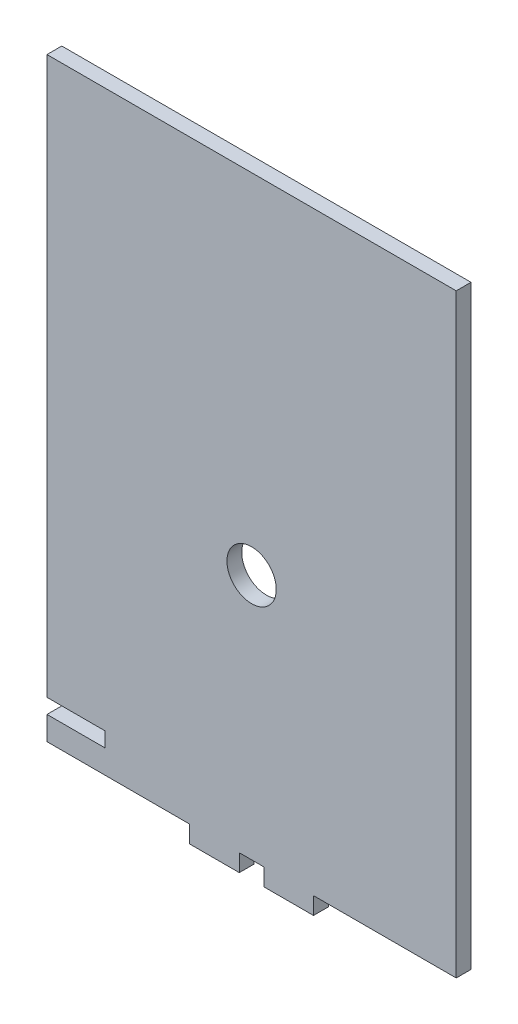
ISO-10303-21;
HEADER;
FILE_DESCRIPTION(('STEP AP214'),'2;1');
FILE_NAME('part.step','',(''),(''),'','','');
FILE_SCHEMA(('AUTOMOTIVE_DESIGN { 1 0 10303 214 1 1 1 1 }'));
ENDSEC;
DATA;
#1=APPLICATION_CONTEXT('core data for automotive mechanical design processes');
#2=APPLICATION_PROTOCOL_DEFINITION('international standard','automotive_design',2000,#1);
#3=PRODUCT_CONTEXT('',#1,'mechanical');
#4=PRODUCT('Part','Part','',(#3));
#5=PRODUCT_RELATED_PRODUCT_CATEGORY('part','',(#4));
#6=PRODUCT_DEFINITION_FORMATION('','',#4);
#7=PRODUCT_DEFINITION_CONTEXT('part definition',#1,'design');
#8=PRODUCT_DEFINITION('design','',#6,#7);
#9=PRODUCT_DEFINITION_SHAPE('','',#8);
#10=(LENGTH_UNIT() NAMED_UNIT(*) SI_UNIT(.MILLI.,.METRE.));
#11=(NAMED_UNIT(*) PLANE_ANGLE_UNIT() SI_UNIT($,.RADIAN.));
#12=(NAMED_UNIT(*) SI_UNIT($,.STERADIAN.) SOLID_ANGLE_UNIT());
#13=UNCERTAINTY_MEASURE_WITH_UNIT(LENGTH_MEASURE(1.E-05),#10,'distance_accuracy_value','');
#14=(GEOMETRIC_REPRESENTATION_CONTEXT(3) GLOBAL_UNCERTAINTY_ASSIGNED_CONTEXT((#13)) GLOBAL_UNIT_ASSIGNED_CONTEXT((#10,
#11,#12)) REPRESENTATION_CONTEXT('',''));
#15=CARTESIAN_POINT('',(0.,0.,0.));
#16=DIRECTION('',(0.,0.,1.));
#17=DIRECTION('',(1.,0.,0.));
#18=AXIS2_PLACEMENT_3D('',#15,#16,#17);
#19=CARTESIAN_POINT('',(43.8354800636653,2.00252965900021E-12,3.));
#20=DIRECTION('',(-1.,0.,0.));
#21=DIRECTION('',(0.,-1.,0.));
#22=AXIS2_PLACEMENT_3D('',#19,#20,#21);
#23=PLANE('',#22);
#24=DIRECTION('',(0.,1.,0.));
#25=VECTOR('',#24,1.);
#26=CARTESIAN_POINT('',(43.8354800636653,2.00252965900021E-12,0.));
#27=LINE('',#26,#25);
#28=CARTESIAN_POINT('',(43.8354800636669,-35.8425477631779,0.));
#29=VERTEX_POINT('',#28);
#30=CARTESIAN_POINT('',(43.8354800636668,-32.3490144152469,0.));
#31=VERTEX_POINT('',#30);
#32=EDGE_CURVE('E184',#29,#31,#27,.T.);
#33=ORIENTED_EDGE('',*,*,#32,.F.);
#34=DIRECTION('',(0.,0.,-1.));
#35=VECTOR('',#34,1.);
#36=CARTESIAN_POINT('',(43.8354800636669,-35.8425477631779,3.));
#37=LINE('',#36,#35);
#38=CARTESIAN_POINT('',(43.8354800636669,-35.8425477631779,3.));
#39=VERTEX_POINT('',#38);
#40=EDGE_CURVE('E11',#39,#29,#37,.T.);
#41=ORIENTED_EDGE('',*,*,#40,.F.);
#42=DIRECTION('',(0.,1.,0.));
#43=VECTOR('',#42,1.);
#44=CARTESIAN_POINT('',(43.8354800636653,2.00252965900021E-12,3.));
#45=LINE('',#44,#43);
#46=CARTESIAN_POINT('',(43.8354800636668,-32.3490144152469,3.));
#47=VERTEX_POINT('',#46);
#48=EDGE_CURVE('E279',#39,#47,#45,.T.);
#49=ORIENTED_EDGE('',*,*,#48,.T.);
#50=DIRECTION('',(0.,0.,-1.));
#51=VECTOR('',#50,1.);
#52=CARTESIAN_POINT('',(43.8354800636668,-32.3490144152469,3.));
#53=LINE('',#52,#51);
#54=EDGE_CURVE('E50',#47,#31,#53,.T.);
#55=ORIENTED_EDGE('',*,*,#54,.T.);
#56=EDGE_LOOP('',(#33,#41,#49,#55));
#57=FACE_BOUND('',#56,.T.);
#58=ADVANCED_FACE('F33',(#57),#23,.T.);
#59=CARTESIAN_POINT('',(0.,-35.8425477631779,3.));
#60=DIRECTION('',(0.,-1.,0.));
#61=DIRECTION('',(0.,0.,-1.));
#62=AXIS2_PLACEMENT_3D('',#59,#60,#61);
#63=PLANE('',#62);
#64=DIRECTION('',(-1.,0.,0.));
#65=VECTOR('',#64,1.);
#66=CARTESIAN_POINT('',(0.,-35.8425477631779,0.));
#67=LINE('',#66,#65);
#68=CARTESIAN_POINT('',(53.8854800636669,-35.8425477631779,0.));
#69=VERTEX_POINT('',#68);
#70=EDGE_CURVE('E186',#69,#29,#67,.T.);
#71=ORIENTED_EDGE('',*,*,#70,.F.);
#72=DIRECTION('',(0.,0.,-1.));
#73=VECTOR('',#72,1.);
#74=CARTESIAN_POINT('',(53.8854800636669,-35.8425477631779,3.));
#75=LINE('',#74,#73);
#76=CARTESIAN_POINT('',(53.8854800636669,-35.8425477631779,3.));
#77=VERTEX_POINT('',#76);
#78=EDGE_CURVE('E42',#77,#69,#75,.T.);
#79=ORIENTED_EDGE('',*,*,#78,.F.);
#80=DIRECTION('',(-1.,0.,0.));
#81=VECTOR('',#80,1.);
#82=CARTESIAN_POINT('',(0.,-35.8425477631779,3.));
#83=LINE('',#82,#81);
#84=EDGE_CURVE('E275',#77,#39,#83,.T.);
#85=ORIENTED_EDGE('',*,*,#84,.T.);
#86=ORIENTED_EDGE('',*,*,#40,.T.);
#87=EDGE_LOOP('',(#71,#79,#85,#86));
#88=FACE_BOUND('',#87,.T.);
#89=ADVANCED_FACE('F263',(#88),#63,.T.);
#90=CARTESIAN_POINT('',(53.8854800636669,0.,3.));
#91=DIRECTION('',(1.,0.,0.));
#92=DIRECTION('',(0.,0.,-1.));
#93=AXIS2_PLACEMENT_3D('',#90,#91,#92);
#94=PLANE('',#93);
#95=DIRECTION('',(0.,-1.,0.));
#96=VECTOR('',#95,1.);
#97=CARTESIAN_POINT('',(53.8854800636669,0.,0.));
#98=LINE('',#97,#96);
#99=CARTESIAN_POINT('',(53.8854800636669,-32.3425477631779,0.));
#100=VERTEX_POINT('',#99);
#101=EDGE_CURVE('E189',#100,#69,#98,.T.);
#102=ORIENTED_EDGE('',*,*,#101,.F.);
#103=DIRECTION('',(0.,0.,-1.));
#104=VECTOR('',#103,1.);
#105=CARTESIAN_POINT('',(53.8854800636669,-32.3425477631779,3.));
#106=LINE('',#105,#104);
#107=CARTESIAN_POINT('',(53.8854800636669,-32.3425477631779,3.));
#108=VERTEX_POINT('',#107);
#109=EDGE_CURVE('E252',#108,#100,#106,.T.);
#110=ORIENTED_EDGE('',*,*,#109,.F.);
#111=DIRECTION('',(0.,-1.,0.));
#112=VECTOR('',#111,1.);
#113=CARTESIAN_POINT('',(53.8854800636669,0.,3.));
#114=LINE('',#113,#112);
#115=EDGE_CURVE('E259',#108,#77,#114,.T.);
#116=ORIENTED_EDGE('',*,*,#115,.T.);
#117=ORIENTED_EDGE('',*,*,#78,.T.);
#118=EDGE_LOOP('',(#102,#110,#116,#117));
#119=FACE_BOUND('',#118,.T.);
#120=ADVANCED_FACE('F257',(#119),#94,.T.);
#121=CARTESIAN_POINT('',(0.,-32.3425477631779,3.));
#122=DIRECTION('',(0.,-1.,0.));
#123=DIRECTION('',(0.,0.,-1.));
#124=AXIS2_PLACEMENT_3D('',#121,#122,#123);
#125=PLANE('',#124);
#126=DIRECTION('',(-1.,0.,0.));
#127=VECTOR('',#126,1.);
#128=CARTESIAN_POINT('',(0.,-32.3425477631779,0.));
#129=LINE('',#128,#127);
#130=CARTESIAN_POINT('',(58.8854800636669,-32.3425477631779,0.));
#131=VERTEX_POINT('',#130);
#132=EDGE_CURVE('E192',#131,#100,#129,.T.);
#133=ORIENTED_EDGE('',*,*,#132,.F.);
#134=DIRECTION('',(0.,0.,-1.));
#135=VECTOR('',#134,1.);
#136=CARTESIAN_POINT('',(58.8854800636669,-32.3425477631779,3.));
#137=LINE('',#136,#135);
#138=CARTESIAN_POINT('',(58.8854800636669,-32.3425477631779,3.));
#139=VERTEX_POINT('',#138);
#140=EDGE_CURVE('E250',#139,#131,#137,.T.);
#141=ORIENTED_EDGE('',*,*,#140,.F.);
#142=DIRECTION('',(-1.,0.,0.));
#143=VECTOR('',#142,1.);
#144=CARTESIAN_POINT('',(0.,-32.3425477631779,3.));
#145=LINE('',#144,#143);
#146=EDGE_CURVE('E272',#139,#108,#145,.T.);
#147=ORIENTED_EDGE('',*,*,#146,.T.);
#148=ORIENTED_EDGE('',*,*,#109,.T.);
#149=EDGE_LOOP('',(#133,#141,#147,#148));
#150=FACE_BOUND('',#149,.T.);
#151=ADVANCED_FACE('F269',(#150),#125,.T.);
#152=CARTESIAN_POINT('',(58.8854800636669,0.,3.));
#153=DIRECTION('',(-1.,0.,0.));
#154=DIRECTION('',(0.,0.,1.));
#155=AXIS2_PLACEMENT_3D('',#152,#153,#154);
#156=PLANE('',#155);
#157=DIRECTION('',(0.,1.,0.));
#158=VECTOR('',#157,1.);
#159=CARTESIAN_POINT('',(58.8854800636669,0.,0.));
#160=LINE('',#159,#158);
#161=CARTESIAN_POINT('',(58.8854800636669,-35.8425477631779,0.));
#162=VERTEX_POINT('',#161);
#163=EDGE_CURVE('E195',#162,#131,#160,.T.);
#164=ORIENTED_EDGE('',*,*,#163,.F.);
#165=DIRECTION('',(0.,0.,-1.));
#166=VECTOR('',#165,1.);
#167=CARTESIAN_POINT('',(58.8854800636669,-35.8425477631779,3.));
#168=LINE('',#167,#166);
#169=CARTESIAN_POINT('',(58.8854800636669,-35.8425477631779,3.));
#170=VERTEX_POINT('',#169);
#171=EDGE_CURVE('E248',#170,#162,#168,.T.);
#172=ORIENTED_EDGE('',*,*,#171,.F.);
#173=DIRECTION('',(0.,1.,0.));
#174=VECTOR('',#173,1.);
#175=CARTESIAN_POINT('',(58.8854800636669,0.,3.));
#176=LINE('',#175,#174);
#177=EDGE_CURVE('E277',#170,#139,#176,.T.);
#178=ORIENTED_EDGE('',*,*,#177,.T.);
#179=ORIENTED_EDGE('',*,*,#140,.T.);
#180=EDGE_LOOP('',(#164,#172,#178,#179));
#181=FACE_BOUND('',#180,.T.);
#182=ADVANCED_FACE('F331',(#181),#156,.T.);
#183=CARTESIAN_POINT('',(0.,-35.8425477631779,3.));
#184=DIRECTION('',(0.,-1.,0.));
#185=DIRECTION('',(1.,0.,0.));
#186=AXIS2_PLACEMENT_3D('',#183,#184,#185);
#187=PLANE('',#186);
#188=DIRECTION('',(-1.,0.,0.));
#189=VECTOR('',#188,1.);
#190=CARTESIAN_POINT('',(0.,-35.8425477631779,0.));
#191=LINE('',#190,#189);
#192=CARTESIAN_POINT('',(68.9354800636669,-35.842547763178,0.));
#193=VERTEX_POINT('',#192);
#194=EDGE_CURVE('E198',#193,#162,#191,.T.);
#195=ORIENTED_EDGE('',*,*,#194,.F.);
#196=DIRECTION('',(0.,0.,-1.));
#197=VECTOR('',#196,1.);
#198=CARTESIAN_POINT('',(68.9354800636669,-35.842547763178,3.));
#199=LINE('',#198,#197);
#200=CARTESIAN_POINT('',(68.9354800636669,-35.842547763178,3.));
#201=VERTEX_POINT('',#200);
#202=EDGE_CURVE('E246',#201,#193,#199,.T.);
#203=ORIENTED_EDGE('',*,*,#202,.F.);
#204=DIRECTION('',(-1.,0.,0.));
#205=VECTOR('',#204,1.);
#206=CARTESIAN_POINT('',(0.,-35.8425477631779,3.));
#207=LINE('',#206,#205);
#208=EDGE_CURVE('E284',#201,#170,#207,.T.);
#209=ORIENTED_EDGE('',*,*,#208,.T.);
#210=ORIENTED_EDGE('',*,*,#171,.T.);
#211=EDGE_LOOP('',(#195,#203,#209,#210));
#212=FACE_BOUND('',#211,.T.);
#213=ADVANCED_FACE('F334',(#212),#187,.T.);
#214=CARTESIAN_POINT('',(68.9354800636686,-3.28608959288883E-12,3.));
#215=DIRECTION('',(-1.,0.,0.));
#216=DIRECTION('',(0.,-1.,0.));
#217=AXIS2_PLACEMENT_3D('',#214,#215,#216);
#218=PLANE('',#217);
#219=DIRECTION('',(0.,1.,0.));
#220=VECTOR('',#219,1.);
#221=CARTESIAN_POINT('',(68.9354800636686,-3.28608959288883E-12,0.));
#222=LINE('',#221,#220);
#223=CARTESIAN_POINT('',(68.9354800636671,-32.3490144152485,0.));
#224=VERTEX_POINT('',#223);
#225=EDGE_CURVE('E201',#193,#224,#222,.T.);
#226=ORIENTED_EDGE('',*,*,#225,.T.);
#227=DIRECTION('',(0.,0.,-1.));
#228=VECTOR('',#227,1.);
#229=CARTESIAN_POINT('',(68.9354800636671,-32.3490144152485,3.));
#230=LINE('',#229,#228);
#231=CARTESIAN_POINT('',(68.9354800636671,-32.3490144152485,3.));
#232=VERTEX_POINT('',#231);
#233=EDGE_CURVE('E244',#232,#224,#230,.T.);
#234=ORIENTED_EDGE('',*,*,#233,.F.);
#235=DIRECTION('',(0.,1.,0.));
#236=VECTOR('',#235,1.);
#237=CARTESIAN_POINT('',(68.9354800636686,-3.28608959288883E-12,3.));
#238=LINE('',#237,#236);
#239=EDGE_CURVE('E287',#201,#232,#238,.T.);
#240=ORIENTED_EDGE('',*,*,#239,.F.);
#241=ORIENTED_EDGE('',*,*,#202,.T.);
#242=EDGE_LOOP('',(#226,#234,#240,#241));
#243=FACE_BOUND('',#242,.T.);
#244=ADVANCED_FACE('F338',(#243),#218,.F.);
#245=CARTESIAN_POINT('',(0.00215412260237565,-32.3536040379469,3.));
#246=DIRECTION('',(6.65806070654304E-05,-0.999999997783511,0.));
#247=DIRECTION('',(0.999999997783511,6.65806070654304E-05,0.));
#248=AXIS2_PLACEMENT_3D('',#245,#246,#247);
#249=PLANE('',#248);
#250=DIRECTION('',(-0.999999997783511,-6.65806070654304E-05,0.));
#251=VECTOR('',#250,1.);
#252=CARTESIAN_POINT('',(0.00215412260237565,-32.3536040379469,0.));
#253=LINE('',#252,#251);
#254=CARTESIAN_POINT('',(97.8855052491869,-32.3470869049928,0.));
#255=VERTEX_POINT('',#254);
#256=EDGE_CURVE('E204',#255,#224,#253,.T.);
#257=ORIENTED_EDGE('',*,*,#256,.F.);
#258=DIRECTION('',(0.,0.,-1.));
#259=VECTOR('',#258,1.);
#260=CARTESIAN_POINT('',(97.8855052491869,-32.3470869049928,3.));
#261=LINE('',#260,#259);
#262=CARTESIAN_POINT('',(97.8855052491869,-32.3470869049928,3.));
#263=VERTEX_POINT('',#262);
#264=EDGE_CURVE('E242',#263,#255,#261,.T.);
#265=ORIENTED_EDGE('',*,*,#264,.F.);
#266=DIRECTION('',(-0.999999997783511,-6.65806070654304E-05,0.));
#267=VECTOR('',#266,1.);
#268=CARTESIAN_POINT('',(0.00215412260237565,-32.3536040379469,3.));
#269=LINE('',#268,#267);
#270=EDGE_CURVE('E289',#263,#232,#269,.T.);
#271=ORIENTED_EDGE('',*,*,#270,.T.);
#272=ORIENTED_EDGE('',*,*,#233,.T.);
#273=EDGE_LOOP('',(#257,#265,#271,#272));
#274=FACE_BOUND('',#273,.T.);
#275=ADVANCED_FACE('F342',(#274),#249,.T.);
#276=CARTESIAN_POINT('',(97.8855052491869,0.,3.));
#277=DIRECTION('',(1.,0.,0.));
#278=DIRECTION('',(0.,0.,-1.));
#279=AXIS2_PLACEMENT_3D('',#276,#277,#278);
#280=PLANE('',#279);
#281=DIRECTION('',(0.,-1.,0.));
#282=VECTOR('',#281,1.);
#283=CARTESIAN_POINT('',(97.8855052491869,0.,0.));
#284=LINE('',#283,#282);
#285=CARTESIAN_POINT('',(97.8855052491869,88.349799035052,0.));
#286=VERTEX_POINT('',#285);
#287=EDGE_CURVE('E207',#286,#255,#284,.T.);
#288=ORIENTED_EDGE('',*,*,#287,.F.);
#289=DIRECTION('',(0.,0.,-1.));
#290=VECTOR('',#289,1.);
#291=CARTESIAN_POINT('',(97.8855052491869,88.349799035052,3.));
#292=LINE('',#291,#290);
#293=CARTESIAN_POINT('',(97.8855052491869,88.349799035052,3.));
#294=VERTEX_POINT('',#293);
#295=EDGE_CURVE('E240',#294,#286,#292,.T.);
#296=ORIENTED_EDGE('',*,*,#295,.F.);
#297=DIRECTION('',(0.,-1.,0.));
#298=VECTOR('',#297,1.);
#299=CARTESIAN_POINT('',(97.8855052491869,0.,3.));
#300=LINE('',#299,#298);
#301=EDGE_CURVE('E292',#294,#263,#300,.T.);
#302=ORIENTED_EDGE('',*,*,#301,.T.);
#303=ORIENTED_EDGE('',*,*,#264,.T.);
#304=EDGE_LOOP('',(#288,#296,#302,#303));
#305=FACE_BOUND('',#304,.T.);
#306=ADVANCED_FACE('F346',(#305),#280,.T.);
#307=CARTESIAN_POINT('',(2.3995998528145E-05,88.3498256209547,3.));
#308=DIRECTION('',(2.71602104016523E-07,0.999999999999963,0.));
#309=DIRECTION('',(-0.999999999999963,2.71602104016523E-07,0.));
#310=AXIS2_PLACEMENT_3D('',#307,#308,#309);
#311=PLANE('',#310);
#312=DIRECTION('',(0.999999999999963,-2.71602104016523E-07,0.));
#313=VECTOR('',#312,1.);
#314=CARTESIAN_POINT('',(2.3995998528145E-05,88.3498256209547,0.));
#315=LINE('',#314,#313);
#316=CARTESIAN_POINT('',(14.885503897127,88.349821578027,0.));
#317=VERTEX_POINT('',#316);
#318=EDGE_CURVE('E210',#317,#286,#315,.T.);
#319=ORIENTED_EDGE('',*,*,#318,.F.);
#320=DIRECTION('',(0.,0.,-1.));
#321=VECTOR('',#320,1.);
#322=CARTESIAN_POINT('',(14.885503897127,88.349821578027,3.));
#323=LINE('',#322,#321);
#324=CARTESIAN_POINT('',(14.885503897127,88.349821578027,3.));
#325=VERTEX_POINT('',#324);
#326=EDGE_CURVE('E238',#325,#317,#323,.T.);
#327=ORIENTED_EDGE('',*,*,#326,.F.);
#328=DIRECTION('',(0.999999999999963,-2.71602104016523E-07,0.));
#329=VECTOR('',#328,1.);
#330=CARTESIAN_POINT('',(2.3995998528145E-05,88.3498256209547,3.));
#331=LINE('',#330,#329);
#332=EDGE_CURVE('E295',#325,#294,#331,.T.);
#333=ORIENTED_EDGE('',*,*,#332,.T.);
#334=ORIENTED_EDGE('',*,*,#295,.T.);
#335=EDGE_LOOP('',(#319,#327,#333,#334));
#336=FACE_BOUND('',#335,.T.);
#337=ADVANCED_FACE('F350',(#336),#311,.T.);
#338=CARTESIAN_POINT('',(14.8854849532754,-2.96470992475978E-06,3.));
#339=DIRECTION('',(-0.99999999999998,1.99167842637693E-07,0.));
#340=DIRECTION('',(-1.99167842637694E-07,-0.99999999999998,0.));
#341=AXIS2_PLACEMENT_3D('',#338,#339,#340);
#342=PLANE('',#341);
#343=DIRECTION('',(1.99167842637693E-07,0.99999999999998,0.));
#344=VECTOR('',#343,1.);
#345=CARTESIAN_POINT('',(14.8854849532754,-2.96470992475978E-06,0.));
#346=LINE('',#345,#344);
#347=CARTESIAN_POINT('',(14.8854800636669,-24.5501937322672,0.));
#348=VERTEX_POINT('',#347);
#349=CARTESIAN_POINT('',(14.8854838472356,-5.55330823463518,0.));
#350=VERTEX_POINT('',#349);
#351=EDGE_CURVE('E215',#348,#350,#346,.T.);
#352=ORIENTED_EDGE('',*,*,#351,.F.);
#353=DIRECTION('',(0.,0.,-1.));
#354=VECTOR('',#353,1.);
#355=CARTESIAN_POINT('',(14.8854800636669,-24.5501937322672,3.));
#356=LINE('',#355,#354);
#357=CARTESIAN_POINT('',(14.8854800636669,-24.5501937322672,3.));
#358=VERTEX_POINT('',#357);
#359=EDGE_CURVE('E236',#358,#348,#356,.T.);
#360=ORIENTED_EDGE('',*,*,#359,.F.);
#361=DIRECTION('',(1.99167842637693E-07,0.99999999999998,0.));
#362=VECTOR('',#361,1.);
#363=CARTESIAN_POINT('',(14.8854849532754,-2.96470992475978E-06,3.));
#364=LINE('',#363,#362);
#365=CARTESIAN_POINT('',(14.8854838472356,-5.55330823463518,3.));
#366=VERTEX_POINT('',#365);
#367=EDGE_CURVE('E300',#358,#366,#364,.T.);
#368=ORIENTED_EDGE('',*,*,#367,.T.);
#369=DIRECTION('',(-2.13516752554099E-07,-0.999999999999977,0.));
#370=VECTOR('',#369,1.);
#371=CARTESIAN_POINT('',(14.8854850329593,-3.17830042443018E-06,3.));
#372=LINE('',#371,#370);
#373=EDGE_CURVE('E298',#325,#366,#372,.T.);
#374=ORIENTED_EDGE('',*,*,#373,.F.);
#375=ORIENTED_EDGE('',*,*,#326,.T.);
#376=DIRECTION('',(-2.13516752554099E-07,-0.999999999999977,0.));
#377=VECTOR('',#376,1.);
#378=CARTESIAN_POINT('',(14.8854850329593,-3.17830042443018E-06,0.));
#379=LINE('',#378,#377);
#380=EDGE_CURVE('E213',#317,#350,#379,.T.);
#381=ORIENTED_EDGE('',*,*,#380,.T.);
#382=EDGE_LOOP('',(#352,#360,#368,#374,#375,#381));
#383=FACE_BOUND('',#382,.T.);
#384=ADVANCED_FACE('F354',(#383),#342,.T.);
#385=CARTESIAN_POINT('',(-9.20449600086133E-07,-24.5501931741724,3.));
#386=DIRECTION('',(-3.74925603866317E-08,-0.999999999999999,0.));
#387=DIRECTION('',(0.999999999999999,-3.74925603866317E-08,0.));
#388=AXIS2_PLACEMENT_3D('',#385,#386,#387);
#389=PLANE('',#388);
#390=DIRECTION('',(-0.999999999999999,3.74925603866317E-08,0.));
#391=VECTOR('',#390,1.);
#392=CARTESIAN_POINT('',(-9.20449600086133E-07,-24.5501931741724,0.));
#393=LINE('',#392,#391);
#394=CARTESIAN_POINT('',(26.6854803930124,-24.5501941746794,0.));
#395=VERTEX_POINT('',#394);
#396=EDGE_CURVE('E218',#395,#348,#393,.T.);
#397=ORIENTED_EDGE('',*,*,#396,.F.);
#398=DIRECTION('',(0.,0.,-1.));
#399=VECTOR('',#398,1.);
#400=CARTESIAN_POINT('',(26.6854803930124,-24.5501941746794,3.));
#401=LINE('',#400,#399);
#402=CARTESIAN_POINT('',(26.6854803930124,-24.5501941746794,3.));
#403=VERTEX_POINT('',#402);
#404=EDGE_CURVE('E234',#403,#395,#401,.T.);
#405=ORIENTED_EDGE('',*,*,#404,.F.);
#406=DIRECTION('',(-0.999999999999999,3.74925603866317E-08,0.));
#407=VECTOR('',#406,1.);
#408=CARTESIAN_POINT('',(-9.20449600086133E-07,-24.5501931741724,3.));
#409=LINE('',#408,#407);
#410=EDGE_CURVE('E303',#403,#358,#409,.T.);
#411=ORIENTED_EDGE('',*,*,#410,.T.);
#412=ORIENTED_EDGE('',*,*,#359,.T.);
#413=EDGE_LOOP('',(#397,#405,#411,#412));
#414=FACE_BOUND('',#413,.T.);
#415=ADVANCED_FACE('F358',(#414),#389,.T.);
#416=CARTESIAN_POINT('',(26.685480393012,4.01196720647466E-13,3.));
#417=DIRECTION('',(-1.,0.,0.));
#418=DIRECTION('',(0.,-1.,0.));
#419=AXIS2_PLACEMENT_3D('',#416,#417,#418);
#420=PLANE('',#419);
#421=DIRECTION('',(0.,1.,0.));
#422=VECTOR('',#421,1.);
#423=CARTESIAN_POINT('',(26.685480393012,4.01196720647466E-13,0.));
#424=LINE('',#423,#422);
#425=CARTESIAN_POINT('',(26.6854803930125,-27.5501941746794,0.));
#426=VERTEX_POINT('',#425);
#427=EDGE_CURVE('E221',#426,#395,#424,.T.);
#428=ORIENTED_EDGE('',*,*,#427,.F.);
#429=DIRECTION('',(0.,0.,-1.));
#430=VECTOR('',#429,1.);
#431=CARTESIAN_POINT('',(26.6854803930125,-27.5501941746794,3.));
#432=LINE('',#431,#430);
#433=CARTESIAN_POINT('',(26.6854803930125,-27.5501941746794,3.));
#434=VERTEX_POINT('',#433);
#435=EDGE_CURVE('E163',#434,#426,#432,.T.);
#436=ORIENTED_EDGE('',*,*,#435,.F.);
#437=DIRECTION('',(0.,1.,0.));
#438=VECTOR('',#437,1.);
#439=CARTESIAN_POINT('',(26.685480393012,4.01196720647466E-13,3.));
#440=LINE('',#439,#438);
#441=EDGE_CURVE('E173',#434,#403,#440,.T.);
#442=ORIENTED_EDGE('',*,*,#441,.T.);
#443=ORIENTED_EDGE('',*,*,#404,.T.);
#444=EDGE_LOOP('',(#428,#436,#442,#443));
#445=FACE_BOUND('',#444,.T.);
#446=ADVANCED_FACE('F307',(#445),#420,.T.);
#447=CARTESIAN_POINT('',(0.,-27.5501941746794,3.));
#448=DIRECTION('',(0.,1.,0.));
#449=DIRECTION('',(0.,0.,1.));
#450=AXIS2_PLACEMENT_3D('',#447,#448,#449);
#451=PLANE('',#450);
#452=DIRECTION('',(1.,0.,0.));
#453=VECTOR('',#452,1.);
#454=CARTESIAN_POINT('',(0.,-27.5501941746794,0.));
#455=LINE('',#454,#453);
#456=CARTESIAN_POINT('',(14.8854792020486,-27.5501941746794,0.));
#457=VERTEX_POINT('',#456);
#458=EDGE_CURVE('E159',#457,#426,#455,.T.);
#459=ORIENTED_EDGE('',*,*,#458,.F.);
#460=DIRECTION('',(0.,0.,-1.));
#461=VECTOR('',#460,1.);
#462=CARTESIAN_POINT('',(14.8854792020486,-27.5501941746794,3.));
#463=LINE('',#462,#461);
#464=CARTESIAN_POINT('',(14.8854792020486,-27.5501941746794,3.));
#465=VERTEX_POINT('',#464);
#466=EDGE_CURVE('E154',#465,#457,#463,.T.);
#467=ORIENTED_EDGE('',*,*,#466,.F.);
#468=DIRECTION('',(1.,0.,0.));
#469=VECTOR('',#468,1.);
#470=CARTESIAN_POINT('',(0.,-27.5501941746794,3.));
#471=LINE('',#470,#469);
#472=EDGE_CURVE('E157',#465,#434,#471,.T.);
#473=ORIENTED_EDGE('',*,*,#472,.T.);
#474=ORIENTED_EDGE('',*,*,#435,.T.);
#475=EDGE_LOOP('',(#459,#467,#473,#474));
#476=FACE_BOUND('',#475,.T.);
#477=ADVANCED_FACE('F156',(#476),#451,.T.);
#478=CARTESIAN_POINT('',(14.8854871146301,-4.27520211349189E-06,3.));
#479=DIRECTION('',(-0.999999999999959,2.87206060545365E-07,0.));
#480=DIRECTION('',(-2.87206060545365E-07,-0.999999999999959,0.));
#481=AXIS2_PLACEMENT_3D('',#478,#479,#480);
#482=PLANE('',#481);
#483=DIRECTION('',(2.87206060545365E-07,0.999999999999959,0.));
#484=VECTOR('',#483,1.);
#485=CARTESIAN_POINT('',(14.8854871146301,-4.27520211349189E-06,0.));
#486=LINE('',#485,#484);
#487=CARTESIAN_POINT('',(14.8854778262038,-32.3406391105213,0.));
#488=VERTEX_POINT('',#487);
#489=EDGE_CURVE('E225',#488,#457,#486,.T.);
#490=ORIENTED_EDGE('',*,*,#489,.F.);
#491=DIRECTION('',(0.,0.,-1.));
#492=VECTOR('',#491,1.);
#493=CARTESIAN_POINT('',(14.8854778262038,-32.3406391105213,3.));
#494=LINE('',#493,#492);
#495=CARTESIAN_POINT('',(14.8854778262038,-32.3406391105213,3.));
#496=VERTEX_POINT('',#495);
#497=EDGE_CURVE('E102',#496,#488,#494,.T.);
#498=ORIENTED_EDGE('',*,*,#497,.F.);
#499=DIRECTION('',(2.87206060545365E-07,0.999999999999959,0.));
#500=VECTOR('',#499,1.);
#501=CARTESIAN_POINT('',(14.8854871146301,-4.27520211349189E-06,3.));
#502=LINE('',#501,#500);
#503=EDGE_CURVE('E170',#496,#465,#502,.T.);
#504=ORIENTED_EDGE('',*,*,#503,.T.);
#505=ORIENTED_EDGE('',*,*,#466,.T.);
#506=EDGE_LOOP('',(#490,#498,#504,#505));
#507=FACE_BOUND('',#506,.T.);
#508=ADVANCED_FACE('F175',(#507),#482,.T.);
#509=CARTESIAN_POINT('',(56.3855052491869,17.649799035052,3.));
#510=DIRECTION('',(0.,0.,-1.));
#511=DIRECTION('',(-1.,0.,0.));
#512=AXIS2_PLACEMENT_3D('',#509,#510,#511);
#513=CYLINDRICAL_SURFACE('',#512,5.);
#514=CARTESIAN_POINT('',(56.3855052491869,17.649799035052,3.));
#515=DIRECTION('',(0.,0.,1.));
#516=DIRECTION('',(1.,0.,0.));
#517=AXIS2_PLACEMENT_3D('',#514,#515,#516);
#518=CIRCLE('',#517,5.);
#519=CARTESIAN_POINT('',(61.3855052491869,17.649799035052,3.));
#520=VERTEX_POINT('',#519);
#521=EDGE_CURVE('E230',#520,#520,#518,.T.);
#522=ORIENTED_EDGE('',*,*,#521,.T.);
#523=EDGE_LOOP('',(#522));
#524=FACE_BOUND('',#523,.T.);
#525=CARTESIAN_POINT('',(56.3855052491869,17.649799035052,0.));
#526=DIRECTION('',(0.,0.,1.));
#527=DIRECTION('',(1.,0.,0.));
#528=AXIS2_PLACEMENT_3D('',#525,#526,#527);
#529=CIRCLE('',#528,5.);
#530=CARTESIAN_POINT('',(61.3855052491869,17.649799035052,0.));
#531=VERTEX_POINT('',#530);
#532=EDGE_CURVE('E181',#531,#531,#529,.T.);
#533=ORIENTED_EDGE('',*,*,#532,.F.);
#534=EDGE_LOOP('',(#533));
#535=FACE_BOUND('',#534,.T.);
#536=ADVANCED_FACE('F35',(#524,#535),#513,.F.);
#537=CARTESIAN_POINT('',(-0.00935497742754691,-32.3363299998502,3.));
#538=DIRECTION('',(-0.000289302374020298,-0.999999958152067,0.));
#539=DIRECTION('',(0.999999958152067,-0.000289302374020298,0.));
#540=AXIS2_PLACEMENT_3D('',#537,#538,#539);
#541=PLANE('',#540);
#542=DIRECTION('',(-0.999999958152067,0.000289302374020298,0.));
#543=VECTOR('',#542,1.);
#544=CARTESIAN_POINT('',(-0.00935497742754691,-32.3363299998502,0.));
#545=LINE('',#544,#543);
#546=EDGE_CURVE('E227',#31,#488,#545,.T.);
#547=ORIENTED_EDGE('',*,*,#546,.F.);
#548=ORIENTED_EDGE('',*,*,#54,.F.);
#549=DIRECTION('',(-0.999999958152067,0.000289302374020298,0.));
#550=VECTOR('',#549,1.);
#551=CARTESIAN_POINT('',(-0.00935497742754691,-32.3363299998502,3.));
#552=LINE('',#551,#550);
#553=EDGE_CURVE('E176',#47,#496,#552,.T.);
#554=ORIENTED_EDGE('',*,*,#553,.T.);
#555=ORIENTED_EDGE('',*,*,#497,.T.);
#556=EDGE_LOOP('',(#547,#548,#554,#555));
#557=FACE_BOUND('',#556,.T.);
#558=ADVANCED_FACE('F309',(#557),#541,.T.);
#559=CARTESIAN_POINT('',(0.,0.,3.));
#560=DIRECTION('',(0.,0.,1.));
#561=DIRECTION('',(1.,0.,0.));
#562=AXIS2_PLACEMENT_3D('',#559,#560,#561);
#563=PLANE('',#562);
#564=ORIENTED_EDGE('',*,*,#521,.F.);
#565=EDGE_LOOP('',(#564));
#566=FACE_BOUND('',#565,.T.);
#567=ORIENTED_EDGE('',*,*,#48,.F.);
#568=ORIENTED_EDGE('',*,*,#84,.F.);
#569=ORIENTED_EDGE('',*,*,#115,.F.);
#570=ORIENTED_EDGE('',*,*,#146,.F.);
#571=ORIENTED_EDGE('',*,*,#177,.F.);
#572=ORIENTED_EDGE('',*,*,#208,.F.);
#573=ORIENTED_EDGE('',*,*,#239,.T.);
#574=ORIENTED_EDGE('',*,*,#270,.F.);
#575=ORIENTED_EDGE('',*,*,#301,.F.);
#576=ORIENTED_EDGE('',*,*,#332,.F.);
#577=ORIENTED_EDGE('',*,*,#373,.T.);
#578=ORIENTED_EDGE('',*,*,#367,.F.);
#579=ORIENTED_EDGE('',*,*,#410,.F.);
#580=ORIENTED_EDGE('',*,*,#441,.F.);
#581=ORIENTED_EDGE('',*,*,#472,.F.);
#582=ORIENTED_EDGE('',*,*,#503,.F.);
#583=ORIENTED_EDGE('',*,*,#553,.F.);
#584=EDGE_LOOP('',(#567,#568,#569,#570,#571,#572,#573,#574,#575,#576,#577,#578,#579,#580,#581,
#582,#583));
#585=FACE_BOUND('',#584,.T.);
#586=ADVANCED_FACE('F168',(#566,#585),#563,.T.);
#587=CARTESIAN_POINT('',(0.,0.,0.));
#588=DIRECTION('',(0.,0.,1.));
#589=DIRECTION('',(1.,0.,0.));
#590=AXIS2_PLACEMENT_3D('',#587,#588,#589);
#591=PLANE('',#590);
#592=ORIENTED_EDGE('',*,*,#532,.T.);
#593=EDGE_LOOP('',(#592));
#594=FACE_BOUND('',#593,.T.);
#595=ORIENTED_EDGE('',*,*,#32,.T.);
#596=ORIENTED_EDGE('',*,*,#546,.T.);
#597=ORIENTED_EDGE('',*,*,#489,.T.);
#598=ORIENTED_EDGE('',*,*,#458,.T.);
#599=ORIENTED_EDGE('',*,*,#427,.T.);
#600=ORIENTED_EDGE('',*,*,#396,.T.);
#601=ORIENTED_EDGE('',*,*,#351,.T.);
#602=ORIENTED_EDGE('',*,*,#380,.F.);
#603=ORIENTED_EDGE('',*,*,#318,.T.);
#604=ORIENTED_EDGE('',*,*,#287,.T.);
#605=ORIENTED_EDGE('',*,*,#256,.T.);
#606=ORIENTED_EDGE('',*,*,#225,.F.);
#607=ORIENTED_EDGE('',*,*,#194,.T.);
#608=ORIENTED_EDGE('',*,*,#163,.T.);
#609=ORIENTED_EDGE('',*,*,#132,.T.);
#610=ORIENTED_EDGE('',*,*,#101,.T.);
#611=ORIENTED_EDGE('',*,*,#70,.T.);
#612=EDGE_LOOP('',(#595,#596,#597,#598,#599,#600,#601,#602,#603,#604,#605,#606,#607,#608,#609,
#610,#611));
#613=FACE_BOUND('',#612,.T.);
#614=ADVANCED_FACE('F265',(#594,#613),#591,.F.);
#615=CLOSED_SHELL('',(#58,#89,#120,#151,#182,#213,#244,#275,#306,#337,#384,#415,#446,#477,#508,
#536,#558,#586,#614));
#616=MANIFOLD_SOLID_BREP('B2',#615);
#617=ADVANCED_BREP_SHAPE_REPRESENTATION('',(#18,#616),#14);
#618=SHAPE_DEFINITION_REPRESENTATION(#9,#617);
ENDSEC;
END-ISO-10303-21;
